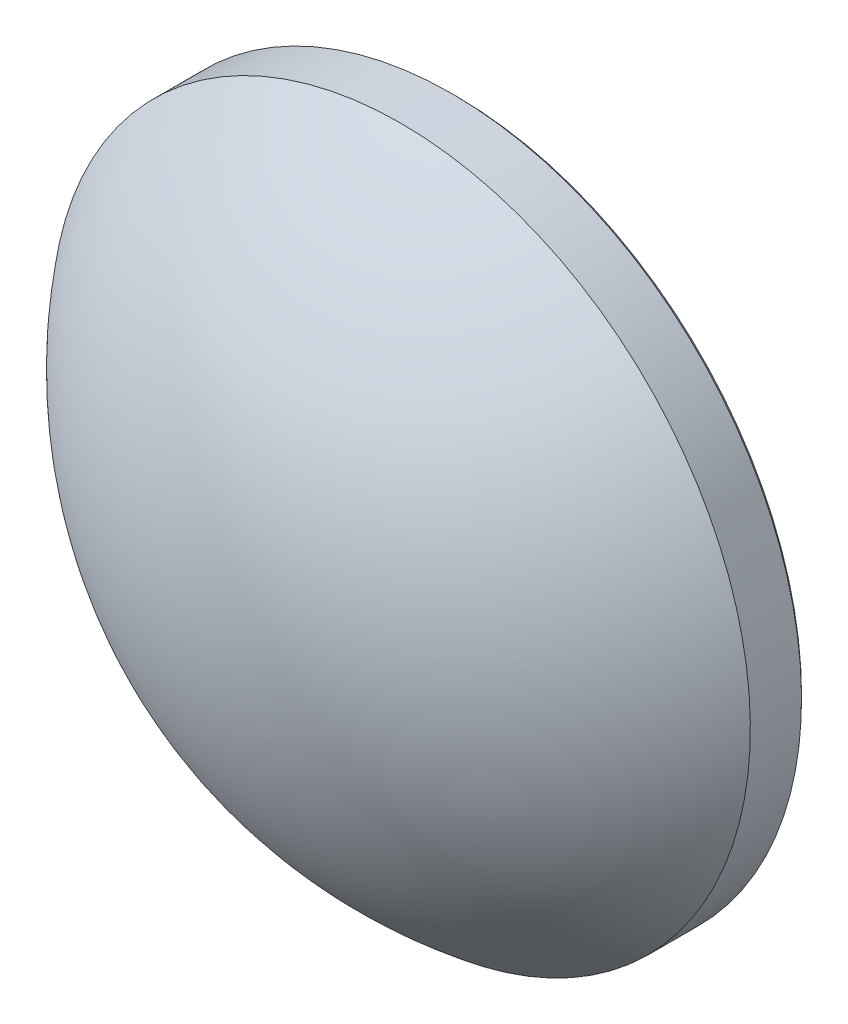
ISO-10303-21;
HEADER;
FILE_DESCRIPTION(('STEP AP214'),'2;1');
FILE_NAME('part.step','',(''),(''),'','','');
FILE_SCHEMA(('AUTOMOTIVE_DESIGN { 1 0 10303 214 1 1 1 1 }'));
ENDSEC;
DATA;
#1=APPLICATION_CONTEXT('core data for automotive mechanical design processes');
#2=APPLICATION_PROTOCOL_DEFINITION('international standard','automotive_design',2000,#1);
#3=PRODUCT_CONTEXT('',#1,'mechanical');
#4=PRODUCT('Part','Part','',(#3));
#5=PRODUCT_RELATED_PRODUCT_CATEGORY('part','',(#4));
#6=PRODUCT_DEFINITION_FORMATION('','',#4);
#7=PRODUCT_DEFINITION_CONTEXT('part definition',#1,'design');
#8=PRODUCT_DEFINITION('design','',#6,#7);
#9=PRODUCT_DEFINITION_SHAPE('','',#8);
#10=(LENGTH_UNIT() NAMED_UNIT(*) SI_UNIT(.MILLI.,.METRE.));
#11=(NAMED_UNIT(*) PLANE_ANGLE_UNIT() SI_UNIT($,.RADIAN.));
#12=(NAMED_UNIT(*) SI_UNIT($,.STERADIAN.) SOLID_ANGLE_UNIT());
#13=UNCERTAINTY_MEASURE_WITH_UNIT(LENGTH_MEASURE(1.E-05),#10,'distance_accuracy_value','');
#14=(GEOMETRIC_REPRESENTATION_CONTEXT(3) GLOBAL_UNCERTAINTY_ASSIGNED_CONTEXT((#13)) GLOBAL_UNIT_ASSIGNED_CONTEXT((#10,
#11,#12)) REPRESENTATION_CONTEXT('',''));
#15=CARTESIAN_POINT('',(0.,0.,0.));
#16=DIRECTION('',(0.,0.,1.));
#17=DIRECTION('',(1.,0.,0.));
#18=AXIS2_PLACEMENT_3D('',#15,#16,#17);
#19=CARTESIAN_POINT('',(0.,0.,-4.1));
#20=DIRECTION('',(0.,0.,-1.));
#21=DIRECTION('',(0.,1.,0.));
#22=AXIS2_PLACEMENT_3D('',#19,#20,#21);
#23=PLANE('',#22);
#24=CARTESIAN_POINT('',(0.,0.,-4.1));
#25=DIRECTION('',(0.,0.,-1.));
#26=DIRECTION('',(0.,1.,0.));
#27=AXIS2_PLACEMENT_3D('',#24,#25,#26);
#28=CIRCLE('',#27,12.5585786437627);
#29=CARTESIAN_POINT('',(0.,12.5585786437627,-4.1));
#30=VERTEX_POINT('',#29);
#31=EDGE_CURVE('E10',#30,#30,#28,.T.);
#32=ORIENTED_EDGE('',*,*,#31,.T.);
#33=EDGE_LOOP('',(#32));
#34=FACE_BOUND('',#33,.T.);
#35=ADVANCED_FACE('F15',(#34),#23,.T.);
#36=CARTESIAN_POINT('',(0.,0.,-4.1));
#37=DIRECTION('',(0.,0.,1.));
#38=DIRECTION('',(0.,-1.,0.));
#39=AXIS2_PLACEMENT_3D('',#36,#37,#38);
#40=CONICAL_SURFACE('',#39,12.5585786437627,0.785398163397436);
#41=CARTESIAN_POINT('',(0.,0.,-3.95857864376269));
#42=DIRECTION('',(0.,0.,-1.));
#43=DIRECTION('',(0.,1.,0.));
#44=AXIS2_PLACEMENT_3D('',#41,#42,#43);
#45=CIRCLE('',#44,12.7);
#46=CARTESIAN_POINT('',(0.,12.7,-3.95857864376269));
#47=VERTEX_POINT('',#46);
#48=EDGE_CURVE('E21',#47,#47,#45,.T.);
#49=ORIENTED_EDGE('',*,*,#48,.T.);
#50=EDGE_LOOP('',(#49));
#51=FACE_BOUND('',#50,.T.);
#52=ORIENTED_EDGE('',*,*,#31,.F.);
#53=EDGE_LOOP('',(#52));
#54=FACE_BOUND('',#53,.T.);
#55=ADVANCED_FACE('F37',(#51,#54),#40,.T.);
#56=CARTESIAN_POINT('',(0.,0.,-37.9506085511944));
#57=DIRECTION('',(0.,0.,-1.));
#58=DIRECTION('',(0.,1.,0.));
#59=AXIS2_PLACEMENT_3D('',#56,#57,#58);
#60=CYLINDRICAL_SURFACE('',#59,12.7);
#61=CARTESIAN_POINT('',(0.,0.,-2.1));
#62=DIRECTION('',(0.,0.,-1.));
#63=DIRECTION('',(0.,1.,0.));
#64=AXIS2_PLACEMENT_3D('',#61,#62,#63);
#65=CIRCLE('',#64,12.7);
#66=CARTESIAN_POINT('',(0.,12.7,-2.1));
#67=VERTEX_POINT('',#66);
#68=EDGE_CURVE('E31',#67,#67,#65,.T.);
#69=ORIENTED_EDGE('',*,*,#68,.T.);
#70=EDGE_LOOP('',(#69));
#71=FACE_BOUND('',#70,.T.);
#72=ORIENTED_EDGE('',*,*,#48,.F.);
#73=EDGE_LOOP('',(#72));
#74=FACE_BOUND('',#73,.T.);
#75=ADVANCED_FACE('F27',(#71,#74),#60,.T.);
#76=CARTESIAN_POINT('',(0.,0.00354349745566515,-11.9999996100505));
#77=DIRECTION('',(-1.,0.,0.));
#78=DIRECTION('',(0.,1.,0.));
#79=AXIS2_PLACEMENT_3D('',#76,#77,#78);
#80=CIRCLE('',#79,16.1);
#81=TRIMMED_CURVE('',#80,(PARAMETER_VALUE(-1.57101641980634)),
(PARAMETER_VALUE(1.57101641980634)),.T.,.PARAMETER.);
#82=CARTESIAN_POINT('',(0.,0.,-11.9999996100505));
#83=DIRECTION('',(0.,0.,-1.));
#84=AXIS1_PLACEMENT('',#82,#83);
#85=SURFACE_OF_REVOLUTION('',#81,#84);
#86=CARTESIAN_POINT('',(0.,0.,4.1));
#87=VERTEX_POINT('',#86);
#88=VERTEX_LOOP('',#87);
#89=FACE_BOUND('',#88,.T.);
#90=ORIENTED_EDGE('',*,*,#68,.F.);
#91=EDGE_LOOP('',(#90));
#92=FACE_BOUND('',#91,.T.);
#93=ADVANCED_FACE('F24',(#89,#92),#85,.T.);
#94=CLOSED_SHELL('',(#35,#55,#75,#93));
#95=MANIFOLD_SOLID_BREP('B1',#94);
#96=ADVANCED_BREP_SHAPE_REPRESENTATION('',(#18,#95),#14);
#97=SHAPE_DEFINITION_REPRESENTATION(#9,#96);
ENDSEC;
END-ISO-10303-21;
